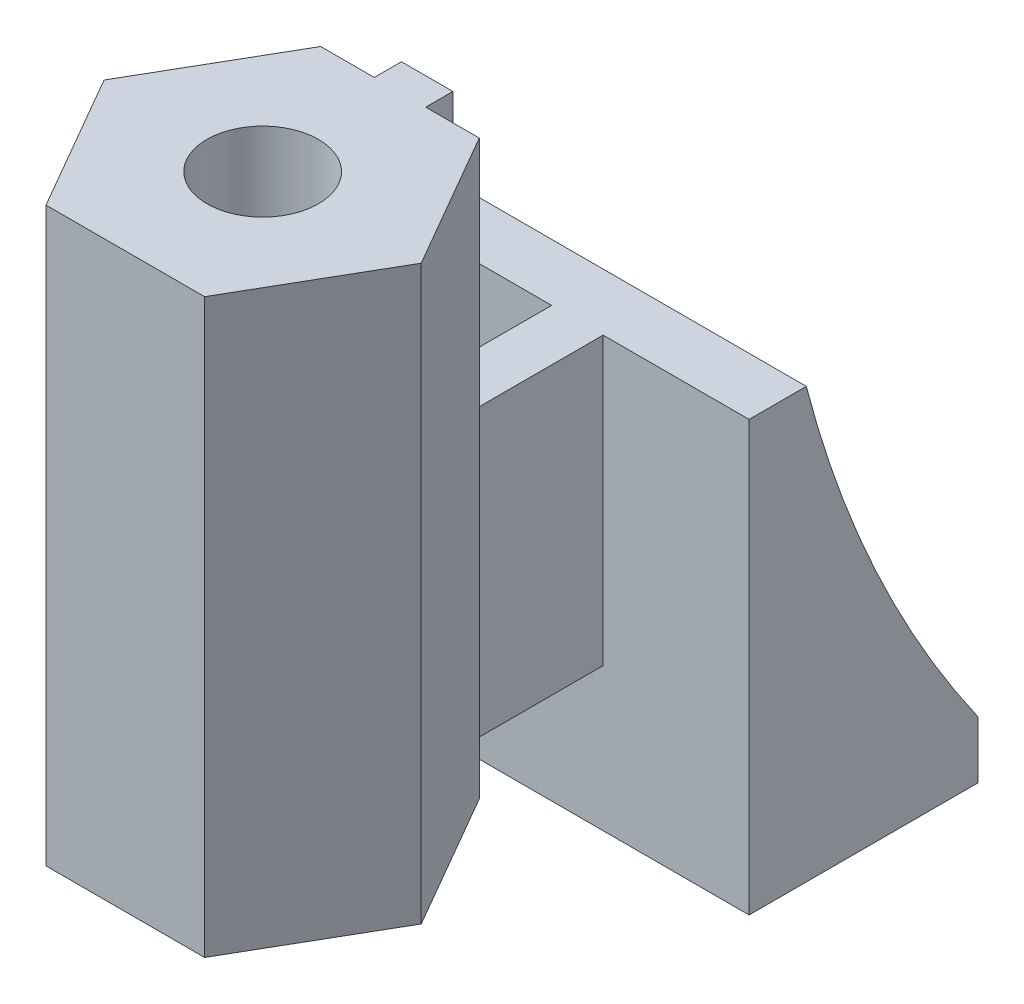
ISO-10303-21;
HEADER;
FILE_DESCRIPTION(('STEP AP214'),'2;1');
FILE_NAME('part.step','',(''),(''),'','','');
FILE_SCHEMA(('AUTOMOTIVE_DESIGN { 1 0 10303 214 1 1 1 1 }'));
ENDSEC;
DATA;
#1=APPLICATION_CONTEXT('core data for automotive mechanical design processes');
#2=APPLICATION_PROTOCOL_DEFINITION('international standard','automotive_design',2000,#1);
#3=PRODUCT_CONTEXT('',#1,'mechanical');
#4=PRODUCT('Part','Part','',(#3));
#5=PRODUCT_RELATED_PRODUCT_CATEGORY('part','',(#4));
#6=PRODUCT_DEFINITION_FORMATION('','',#4);
#7=PRODUCT_DEFINITION_CONTEXT('part definition',#1,'design');
#8=PRODUCT_DEFINITION('design','',#6,#7);
#9=PRODUCT_DEFINITION_SHAPE('','',#8);
#10=(LENGTH_UNIT() NAMED_UNIT(*) SI_UNIT(.MILLI.,.METRE.));
#11=(NAMED_UNIT(*) PLANE_ANGLE_UNIT() SI_UNIT($,.RADIAN.));
#12=(NAMED_UNIT(*) SI_UNIT($,.STERADIAN.) SOLID_ANGLE_UNIT());
#13=UNCERTAINTY_MEASURE_WITH_UNIT(LENGTH_MEASURE(1.E-05),#10,'distance_accuracy_value','');
#14=(GEOMETRIC_REPRESENTATION_CONTEXT(3) GLOBAL_UNCERTAINTY_ASSIGNED_CONTEXT((#13)) GLOBAL_UNIT_ASSIGNED_CONTEXT((#10,
#11,#12)) REPRESENTATION_CONTEXT('',''));
#15=CARTESIAN_POINT('',(0.,0.,0.));
#16=DIRECTION('',(0.,0.,1.));
#17=DIRECTION('',(1.,0.,0.));
#18=AXIS2_PLACEMENT_3D('',#15,#16,#17);
#19=CARTESIAN_POINT('',(-0.9,20.,-4.8));
#20=DIRECTION('',(0.,0.,1.));
#21=DIRECTION('',(1.,0.,0.));
#22=AXIS2_PLACEMENT_3D('',#19,#20,#21);
#23=PLANE('',#22);
#24=DIRECTION('',(-1.,0.,0.));
#25=VECTOR('',#24,1.);
#26=CARTESIAN_POINT('',(-0.9,0.,-4.8));
#27=LINE('',#26,#25);
#28=CARTESIAN_POINT('',(-0.9,0.,-4.8));
#29=VERTEX_POINT('',#28);
#30=CARTESIAN_POINT('',(-2.7712812921102,0.,-4.8));
#31=VERTEX_POINT('',#30);
#32=EDGE_CURVE('E197',#29,#31,#27,.T.);
#33=ORIENTED_EDGE('',*,*,#32,.T.);
#34=DIRECTION('',(0.,-1.,0.));
#35=VECTOR('',#34,1.);
#36=CARTESIAN_POINT('',(-2.7712812921102,20.,-4.8));
#37=LINE('',#36,#35);
#38=CARTESIAN_POINT('',(-2.7712812921102,20.,-4.8));
#39=VERTEX_POINT('',#38);
#40=EDGE_CURVE('E41',#39,#31,#37,.T.);
#41=ORIENTED_EDGE('',*,*,#40,.F.);
#42=DIRECTION('',(-1.,0.,0.));
#43=VECTOR('',#42,1.);
#44=CARTESIAN_POINT('',(-0.9,20.,-4.8));
#45=LINE('',#44,#43);
#46=CARTESIAN_POINT('',(-0.9,20.,-4.8));
#47=VERTEX_POINT('',#46);
#48=EDGE_CURVE('E198',#47,#39,#45,.T.);
#49=ORIENTED_EDGE('',*,*,#48,.F.);
#50=DIRECTION('',(0.,-1.,0.));
#51=VECTOR('',#50,1.);
#52=CARTESIAN_POINT('',(-0.9,20.,-4.8));
#53=LINE('',#52,#51);
#54=EDGE_CURVE('E220',#47,#29,#53,.T.);
#55=ORIENTED_EDGE('',*,*,#54,.T.);
#56=EDGE_LOOP('',(#33,#41,#49,#55));
#57=FACE_BOUND('',#56,.T.);
#58=ADVANCED_FACE('F38',(#57),#23,.F.);
#59=CARTESIAN_POINT('',(-2.7712812921102,20.,-4.8));
#60=DIRECTION('',(0.866025403784439,0.,0.5));
#61=DIRECTION('',(0.5,0.,-0.866025403784439));
#62=AXIS2_PLACEMENT_3D('',#59,#60,#61);
#63=PLANE('',#62);
#64=DIRECTION('',(-0.5,0.,0.866025403784439));
#65=VECTOR('',#64,1.);
#66=CARTESIAN_POINT('',(-2.7712812921102,0.,-4.8));
#67=LINE('',#66,#65);
#68=CARTESIAN_POINT('',(-5.54256258422041,0.,0.));
#69=VERTEX_POINT('',#68);
#70=EDGE_CURVE('E223',#31,#69,#67,.T.);
#71=ORIENTED_EDGE('',*,*,#70,.T.);
#72=DIRECTION('',(0.,-1.,0.));
#73=VECTOR('',#72,1.);
#74=CARTESIAN_POINT('',(-5.54256258422041,20.,0.));
#75=LINE('',#74,#73);
#76=CARTESIAN_POINT('',(-5.54256258422041,20.,0.));
#77=VERTEX_POINT('',#76);
#78=EDGE_CURVE('E261',#77,#69,#75,.T.);
#79=ORIENTED_EDGE('',*,*,#78,.F.);
#80=DIRECTION('',(-0.5,0.,0.866025403784439));
#81=VECTOR('',#80,1.);
#82=CARTESIAN_POINT('',(-2.7712812921102,20.,-4.8));
#83=LINE('',#82,#81);
#84=EDGE_CURVE('E201',#39,#77,#83,.T.);
#85=ORIENTED_EDGE('',*,*,#84,.F.);
#86=ORIENTED_EDGE('',*,*,#40,.T.);
#87=EDGE_LOOP('',(#71,#79,#85,#86));
#88=FACE_BOUND('',#87,.T.);
#89=ADVANCED_FACE('F270',(#88),#63,.F.);
#90=CARTESIAN_POINT('',(-5.54256258422041,20.,0.));
#91=DIRECTION('',(0.866025403784439,0.,-0.5));
#92=DIRECTION('',(-0.5,0.,-0.866025403784439));
#93=AXIS2_PLACEMENT_3D('',#90,#91,#92);
#94=PLANE('',#93);
#95=DIRECTION('',(0.5,0.,0.866025403784438));
#96=VECTOR('',#95,1.);
#97=CARTESIAN_POINT('',(-5.54256258422041,0.,0.));
#98=LINE('',#97,#96);
#99=CARTESIAN_POINT('',(-2.7712812921102,0.,4.8));
#100=VERTEX_POINT('',#99);
#101=EDGE_CURVE('E225',#69,#100,#98,.T.);
#102=ORIENTED_EDGE('',*,*,#101,.T.);
#103=DIRECTION('',(0.,-1.,0.));
#104=VECTOR('',#103,1.);
#105=CARTESIAN_POINT('',(-2.7712812921102,20.,4.8));
#106=LINE('',#105,#104);
#107=CARTESIAN_POINT('',(-2.7712812921102,20.,4.8));
#108=VERTEX_POINT('',#107);
#109=EDGE_CURVE('E259',#108,#100,#106,.T.);
#110=ORIENTED_EDGE('',*,*,#109,.F.);
#111=DIRECTION('',(0.5,0.,0.866025403784438));
#112=VECTOR('',#111,1.);
#113=CARTESIAN_POINT('',(-5.54256258422041,20.,0.));
#114=LINE('',#113,#112);
#115=EDGE_CURVE('E204',#77,#108,#114,.T.);
#116=ORIENTED_EDGE('',*,*,#115,.F.);
#117=ORIENTED_EDGE('',*,*,#78,.T.);
#118=EDGE_LOOP('',(#102,#110,#116,#117));
#119=FACE_BOUND('',#118,.T.);
#120=ADVANCED_FACE('F281',(#119),#94,.F.);
#121=CARTESIAN_POINT('',(-2.7712812921102,20.,4.8));
#122=DIRECTION('',(0.,0.,-1.));
#123=DIRECTION('',(-1.,0.,0.));
#124=AXIS2_PLACEMENT_3D('',#121,#122,#123);
#125=PLANE('',#124);
#126=DIRECTION('',(1.,0.,0.));
#127=VECTOR('',#126,1.);
#128=CARTESIAN_POINT('',(-2.7712812921102,0.,4.8));
#129=LINE('',#128,#127);
#130=CARTESIAN_POINT('',(2.77128129211021,0.,4.8));
#131=VERTEX_POINT('',#130);
#132=EDGE_CURVE('E227',#100,#131,#129,.T.);
#133=ORIENTED_EDGE('',*,*,#132,.T.);
#134=DIRECTION('',(0.,-1.,0.));
#135=VECTOR('',#134,1.);
#136=CARTESIAN_POINT('',(2.77128129211021,20.,4.8));
#137=LINE('',#136,#135);
#138=CARTESIAN_POINT('',(2.77128129211021,20.,4.8));
#139=VERTEX_POINT('',#138);
#140=EDGE_CURVE('E256',#139,#131,#137,.T.);
#141=ORIENTED_EDGE('',*,*,#140,.F.);
#142=DIRECTION('',(1.,0.,0.));
#143=VECTOR('',#142,1.);
#144=CARTESIAN_POINT('',(-2.7712812921102,20.,4.8));
#145=LINE('',#144,#143);
#146=EDGE_CURVE('E206',#108,#139,#145,.T.);
#147=ORIENTED_EDGE('',*,*,#146,.F.);
#148=ORIENTED_EDGE('',*,*,#109,.T.);
#149=EDGE_LOOP('',(#133,#141,#147,#148));
#150=FACE_BOUND('',#149,.T.);
#151=ADVANCED_FACE('F284',(#150),#125,.F.);
#152=CARTESIAN_POINT('',(2.77128129211021,20.,4.8));
#153=DIRECTION('',(-0.866025403784439,0.,-0.5));
#154=DIRECTION('',(-0.5,0.,0.866025403784439));
#155=AXIS2_PLACEMENT_3D('',#152,#153,#154);
#156=PLANE('',#155);
#157=DIRECTION('',(0.5,0.,-0.866025403784439));
#158=VECTOR('',#157,1.);
#159=CARTESIAN_POINT('',(2.77128129211021,0.,4.8));
#160=LINE('',#159,#158);
#161=CARTESIAN_POINT('',(5.54256258422041,0.,0.));
#162=VERTEX_POINT('',#161);
#163=EDGE_CURVE('E229',#131,#162,#160,.T.);
#164=ORIENTED_EDGE('',*,*,#163,.T.);
#165=DIRECTION('',(0.,-1.,0.));
#166=VECTOR('',#165,1.);
#167=CARTESIAN_POINT('',(5.54256258422041,20.,0.));
#168=LINE('',#167,#166);
#169=CARTESIAN_POINT('',(5.54256258422041,20.,0.));
#170=VERTEX_POINT('',#169);
#171=EDGE_CURVE('E253',#170,#162,#168,.T.);
#172=ORIENTED_EDGE('',*,*,#171,.F.);
#173=DIRECTION('',(0.5,0.,-0.866025403784439));
#174=VECTOR('',#173,1.);
#175=CARTESIAN_POINT('',(2.77128129211021,20.,4.8));
#176=LINE('',#175,#174);
#177=EDGE_CURVE('E208',#139,#170,#176,.T.);
#178=ORIENTED_EDGE('',*,*,#177,.F.);
#179=ORIENTED_EDGE('',*,*,#140,.T.);
#180=EDGE_LOOP('',(#164,#172,#178,#179));
#181=FACE_BOUND('',#180,.T.);
#182=ADVANCED_FACE('F317',(#181),#156,.F.);
#183=CARTESIAN_POINT('',(5.54256258422041,20.,0.));
#184=DIRECTION('',(-0.866025403784438,0.,0.5));
#185=DIRECTION('',(0.5,0.,0.866025403784438));
#186=AXIS2_PLACEMENT_3D('',#183,#184,#185);
#187=PLANE('',#186);
#188=DIRECTION('',(-0.5,0.,-0.866025403784439));
#189=VECTOR('',#188,1.);
#190=CARTESIAN_POINT('',(5.54256258422041,0.,0.));
#191=LINE('',#190,#189);
#192=CARTESIAN_POINT('',(2.7712812921102,0.,-4.8));
#193=VERTEX_POINT('',#192);
#194=EDGE_CURVE('E231',#162,#193,#191,.T.);
#195=ORIENTED_EDGE('',*,*,#194,.T.);
#196=DIRECTION('',(0.,-1.,0.));
#197=VECTOR('',#196,1.);
#198=CARTESIAN_POINT('',(2.7712812921102,20.,-4.8));
#199=LINE('',#198,#197);
#200=CARTESIAN_POINT('',(2.7712812921102,20.,-4.8));
#201=VERTEX_POINT('',#200);
#202=EDGE_CURVE('E250',#201,#193,#199,.T.);
#203=ORIENTED_EDGE('',*,*,#202,.F.);
#204=DIRECTION('',(-0.5,0.,-0.866025403784439));
#205=VECTOR('',#204,1.);
#206=CARTESIAN_POINT('',(5.54256258422041,20.,0.));
#207=LINE('',#206,#205);
#208=EDGE_CURVE('E210',#170,#201,#207,.T.);
#209=ORIENTED_EDGE('',*,*,#208,.F.);
#210=ORIENTED_EDGE('',*,*,#171,.T.);
#211=EDGE_LOOP('',(#195,#203,#209,#210));
#212=FACE_BOUND('',#211,.T.);
#213=ADVANCED_FACE('F314',(#212),#187,.F.);
#214=CARTESIAN_POINT('',(2.7712812921102,20.,-4.8));
#215=DIRECTION('',(0.,0.,1.));
#216=DIRECTION('',(1.,0.,0.));
#217=AXIS2_PLACEMENT_3D('',#214,#215,#216);
#218=PLANE('',#217);
#219=DIRECTION('',(-1.,0.,0.));
#220=VECTOR('',#219,1.);
#221=CARTESIAN_POINT('',(2.7712812921102,0.,-4.8));
#222=LINE('',#221,#220);
#223=CARTESIAN_POINT('',(0.9,0.,-4.8));
#224=VERTEX_POINT('',#223);
#225=EDGE_CURVE('E233',#193,#224,#222,.T.);
#226=ORIENTED_EDGE('',*,*,#225,.T.);
#227=DIRECTION('',(0.,-1.,0.));
#228=VECTOR('',#227,1.);
#229=CARTESIAN_POINT('',(0.9,20.,-4.8));
#230=LINE('',#229,#228);
#231=CARTESIAN_POINT('',(0.9,20.,-4.8));
#232=VERTEX_POINT('',#231);
#233=EDGE_CURVE('E247',#232,#224,#230,.T.);
#234=ORIENTED_EDGE('',*,*,#233,.F.);
#235=DIRECTION('',(-1.,0.,0.));
#236=VECTOR('',#235,1.);
#237=CARTESIAN_POINT('',(2.7712812921102,20.,-4.8));
#238=LINE('',#237,#236);
#239=EDGE_CURVE('E212',#201,#232,#238,.T.);
#240=ORIENTED_EDGE('',*,*,#239,.F.);
#241=ORIENTED_EDGE('',*,*,#202,.T.);
#242=EDGE_LOOP('',(#226,#234,#240,#241));
#243=FACE_BOUND('',#242,.T.);
#244=ADVANCED_FACE('F310',(#243),#218,.F.);
#245=CARTESIAN_POINT('',(0.9,20.,-4.8));
#246=DIRECTION('',(-1.,0.,0.));
#247=DIRECTION('',(0.,0.,1.));
#248=AXIS2_PLACEMENT_3D('',#245,#246,#247);
#249=PLANE('',#248);
#250=DIRECTION('',(0.,0.,-1.));
#251=VECTOR('',#250,1.);
#252=CARTESIAN_POINT('',(0.9,0.,-4.8));
#253=LINE('',#252,#251);
#254=CARTESIAN_POINT('',(0.899999999999999,0.,-11.));
#255=VERTEX_POINT('',#254);
#256=EDGE_CURVE('E235',#224,#255,#253,.T.);
#257=ORIENTED_EDGE('',*,*,#256,.T.);
#258=DIRECTION('',(0.,-1.,0.));
#259=VECTOR('',#258,1.);
#260=CARTESIAN_POINT('',(0.899999999999999,10.,-11.));
#261=LINE('',#260,#259);
#262=CARTESIAN_POINT('',(0.899999999999999,10.,-11.));
#263=VERTEX_POINT('',#262);
#264=EDGE_CURVE('E194',#263,#255,#261,.T.);
#265=ORIENTED_EDGE('',*,*,#264,.F.);
#266=DIRECTION('',(0.,0.,1.));
#267=VECTOR('',#266,1.);
#268=CARTESIAN_POINT('',(0.9,10.,-5.75));
#269=LINE('',#268,#267);
#270=CARTESIAN_POINT('',(0.9,10.,-5.75));
#271=VERTEX_POINT('',#270);
#272=EDGE_CURVE('E189',#263,#271,#269,.T.);
#273=ORIENTED_EDGE('',*,*,#272,.T.);
#274=DIRECTION('',(0.,-1.,0.));
#275=VECTOR('',#274,1.);
#276=CARTESIAN_POINT('',(0.9,20.,-5.75));
#277=LINE('',#276,#275);
#278=CARTESIAN_POINT('',(0.9,20.,-5.75));
#279=VERTEX_POINT('',#278);
#280=EDGE_CURVE('E244',#279,#271,#277,.T.);
#281=ORIENTED_EDGE('',*,*,#280,.F.);
#282=DIRECTION('',(0.,0.,-1.));
#283=VECTOR('',#282,1.);
#284=CARTESIAN_POINT('',(0.9,20.,-4.8));
#285=LINE('',#284,#283);
#286=EDGE_CURVE('E214',#232,#279,#285,.T.);
#287=ORIENTED_EDGE('',*,*,#286,.F.);
#288=ORIENTED_EDGE('',*,*,#233,.T.);
#289=EDGE_LOOP('',(#257,#265,#273,#281,#287,#288));
#290=FACE_BOUND('',#289,.T.);
#291=ADVANCED_FACE('F303',(#290),#249,.F.);
#292=CARTESIAN_POINT('',(-0.9,20.,-5.75));
#293=DIRECTION('',(0.,0.,1.));
#294=DIRECTION('',(1.,0.,0.));
#295=AXIS2_PLACEMENT_3D('',#292,#293,#294);
#296=PLANE('',#295);
#297=ORIENTED_EDGE('',*,*,#280,.T.);
#298=DIRECTION('',(-1.,0.,0.));
#299=VECTOR('',#298,1.);
#300=CARTESIAN_POINT('',(0.9,10.,-5.75));
#301=LINE('',#300,#299);
#302=CARTESIAN_POINT('',(-0.9,10.,-5.75));
#303=VERTEX_POINT('',#302);
#304=EDGE_CURVE('E519',#271,#303,#301,.T.);
#305=ORIENTED_EDGE('',*,*,#304,.T.);
#306=DIRECTION('',(0.,-1.,0.));
#307=VECTOR('',#306,1.);
#308=CARTESIAN_POINT('',(-0.9,20.,-5.75));
#309=LINE('',#308,#307);
#310=CARTESIAN_POINT('',(-0.9,20.,-5.75));
#311=VERTEX_POINT('',#310);
#312=EDGE_CURVE('E241',#311,#303,#309,.T.);
#313=ORIENTED_EDGE('',*,*,#312,.F.);
#314=DIRECTION('',(-1.,0.,0.));
#315=VECTOR('',#314,1.);
#316=CARTESIAN_POINT('',(-0.9,20.,-5.75));
#317=LINE('',#316,#315);
#318=EDGE_CURVE('E216',#279,#311,#317,.T.);
#319=ORIENTED_EDGE('',*,*,#318,.F.);
#320=EDGE_LOOP('',(#297,#305,#313,#319));
#321=FACE_BOUND('',#320,.T.);
#322=ADVANCED_FACE('F390',(#321),#296,.F.);
#323=CARTESIAN_POINT('',(-0.9,20.,-4.8));
#324=DIRECTION('',(1.,0.,0.));
#325=DIRECTION('',(0.,0.,-1.));
#326=AXIS2_PLACEMENT_3D('',#323,#324,#325);
#327=PLANE('',#326);
#328=DIRECTION('',(0.,0.,1.));
#329=VECTOR('',#328,1.);
#330=CARTESIAN_POINT('',(-0.9,0.,-4.8));
#331=LINE('',#330,#329);
#332=CARTESIAN_POINT('',(-0.899999999999999,0.,-11.));
#333=VERTEX_POINT('',#332);
#334=EDGE_CURVE('E202',#333,#29,#331,.T.);
#335=ORIENTED_EDGE('',*,*,#334,.T.);
#336=ORIENTED_EDGE('',*,*,#54,.F.);
#337=DIRECTION('',(0.,0.,1.));
#338=VECTOR('',#337,1.);
#339=CARTESIAN_POINT('',(-0.9,20.,-4.8));
#340=LINE('',#339,#338);
#341=EDGE_CURVE('E218',#311,#47,#340,.T.);
#342=ORIENTED_EDGE('',*,*,#341,.F.);
#343=ORIENTED_EDGE('',*,*,#312,.T.);
#344=DIRECTION('',(0.,0.,-1.));
#345=VECTOR('',#344,1.);
#346=CARTESIAN_POINT('',(-0.9,10.,-5.75));
#347=LINE('',#346,#345);
#348=CARTESIAN_POINT('',(-0.899999999999999,10.,-11.));
#349=VERTEX_POINT('',#348);
#350=EDGE_CURVE('E61',#303,#349,#347,.T.);
#351=ORIENTED_EDGE('',*,*,#350,.T.);
#352=DIRECTION('',(0.,-1.,0.));
#353=VECTOR('',#352,1.);
#354=CARTESIAN_POINT('',(-0.899999999999999,10.,-11.));
#355=LINE('',#354,#353);
#356=EDGE_CURVE('E183',#349,#333,#355,.T.);
#357=ORIENTED_EDGE('',*,*,#356,.T.);
#358=EDGE_LOOP('',(#335,#336,#342,#343,#351,#357));
#359=FACE_BOUND('',#358,.T.);
#360=ADVANCED_FACE('F294',(#359),#327,.F.);
#361=CARTESIAN_POINT('',(0.,20.,0.));
#362=DIRECTION('',(0.,-1.,0.));
#363=DIRECTION('',(0.,0.,-1.));
#364=AXIS2_PLACEMENT_3D('',#361,#362,#363);
#365=PLANE('',#364);
#366=CARTESIAN_POINT('',(0.,20.,0.));
#367=DIRECTION('',(0.,-1.,0.));
#368=DIRECTION('',(0.,0.,-1.));
#369=AXIS2_PLACEMENT_3D('',#366,#367,#368);
#370=CIRCLE('',#369,1.95);
#371=CARTESIAN_POINT('',(0.,20.,-1.95));
#372=VERTEX_POINT('',#371);
#373=EDGE_CURVE('E193',#372,#372,#370,.F.);
#374=ORIENTED_EDGE('',*,*,#373,.F.);
#375=EDGE_LOOP('',(#374));
#376=FACE_BOUND('',#375,.T.);
#377=ORIENTED_EDGE('',*,*,#48,.T.);
#378=ORIENTED_EDGE('',*,*,#84,.T.);
#379=ORIENTED_EDGE('',*,*,#115,.T.);
#380=ORIENTED_EDGE('',*,*,#146,.T.);
#381=ORIENTED_EDGE('',*,*,#177,.T.);
#382=ORIENTED_EDGE('',*,*,#208,.T.);
#383=ORIENTED_EDGE('',*,*,#239,.T.);
#384=ORIENTED_EDGE('',*,*,#286,.T.);
#385=ORIENTED_EDGE('',*,*,#318,.T.);
#386=ORIENTED_EDGE('',*,*,#341,.T.);
#387=EDGE_LOOP('',(#377,#378,#379,#380,#381,#382,#383,#384,#385,#386));
#388=FACE_BOUND('',#387,.T.);
#389=ADVANCED_FACE('F288',(#376,#388),#365,.F.);
#390=CARTESIAN_POINT('',(0.,0.,0.));
#391=DIRECTION('',(0.,-1.,0.));
#392=DIRECTION('',(0.,0.,-1.));
#393=AXIS2_PLACEMENT_3D('',#390,#391,#392);
#394=PLANE('',#393);
#395=DIRECTION('',(-1.,0.,0.));
#396=VECTOR('',#395,1.);
#397=CARTESIAN_POINT('',(6.,0.,-11.));
#398=LINE('',#397,#396);
#399=EDGE_CURVE('E11',#255,#333,#398,.T.);
#400=ORIENTED_EDGE('',*,*,#399,.F.);
#401=ORIENTED_EDGE('',*,*,#256,.F.);
#402=ORIENTED_EDGE('',*,*,#225,.F.);
#403=ORIENTED_EDGE('',*,*,#194,.F.);
#404=ORIENTED_EDGE('',*,*,#163,.F.);
#405=ORIENTED_EDGE('',*,*,#132,.F.);
#406=ORIENTED_EDGE('',*,*,#101,.F.);
#407=ORIENTED_EDGE('',*,*,#70,.F.);
#408=ORIENTED_EDGE('',*,*,#32,.F.);
#409=ORIENTED_EDGE('',*,*,#334,.F.);
#410=EDGE_LOOP('',(#400,#401,#402,#403,#404,#405,#406,#407,#408,#409));
#411=FACE_BOUND('',#410,.T.);
#412=CARTESIAN_POINT('',(0.,0.,0.));
#413=DIRECTION('',(0.,-1.,0.));
#414=DIRECTION('',(0.,0.,-1.));
#415=AXIS2_PLACEMENT_3D('',#412,#413,#414);
#416=CIRCLE('',#415,1.95);
#417=CARTESIAN_POINT('',(0.,0.,-1.95));
#418=VERTEX_POINT('',#417);
#419=EDGE_CURVE('E190',#418,#418,#416,.T.);
#420=ORIENTED_EDGE('',*,*,#419,.F.);
#421=EDGE_LOOP('',(#420));
#422=FACE_BOUND('',#421,.T.);
#423=ADVANCED_FACE('F276',(#411,#422),#394,.T.);
#424=CARTESIAN_POINT('',(0.,25.5154328932551,0.));
#425=DIRECTION('',(0.,-1.,0.));
#426=DIRECTION('',(0.,0.,-1.));
#427=AXIS2_PLACEMENT_3D('',#424,#425,#426);
#428=CYLINDRICAL_SURFACE('',#427,1.95);
#429=ORIENTED_EDGE('',*,*,#373,.T.);
#430=EDGE_LOOP('',(#429));
#431=FACE_BOUND('',#430,.T.);
#432=ORIENTED_EDGE('',*,*,#419,.T.);
#433=EDGE_LOOP('',(#432));
#434=FACE_BOUND('',#433,.T.);
#435=ADVANCED_FACE('F378',(#431,#434),#428,.F.);
#436=CARTESIAN_POINT('',(0.899999999999999,10.,-11.));
#437=DIRECTION('',(0.,0.,1.));
#438=DIRECTION('',(1.,0.,0.));
#439=AXIS2_PLACEMENT_3D('',#436,#437,#438);
#440=PLANE('',#439);
#441=ORIENTED_EDGE('',*,*,#264,.T.);
#442=ORIENTED_EDGE('',*,*,#399,.T.);
#443=ORIENTED_EDGE('',*,*,#356,.F.);
#444=DIRECTION('',(-1.,0.,0.));
#445=VECTOR('',#444,1.);
#446=CARTESIAN_POINT('',(-0.899999999999999,10.,-11.));
#447=LINE('',#446,#445);
#448=CARTESIAN_POINT('',(-6.,10.,-11.));
#449=VERTEX_POINT('',#448);
#450=EDGE_CURVE('E502',#349,#449,#447,.T.);
#451=ORIENTED_EDGE('',*,*,#450,.T.);
#452=DIRECTION('',(0.,-1.,0.));
#453=VECTOR('',#452,1.);
#454=CARTESIAN_POINT('',(-6.,10.,-11.));
#455=LINE('',#454,#453);
#456=CARTESIAN_POINT('',(-6.,-5.,-11.));
#457=VERTEX_POINT('',#456);
#458=EDGE_CURVE('E179',#449,#457,#455,.T.);
#459=ORIENTED_EDGE('',*,*,#458,.T.);
#460=DIRECTION('',(-1.,0.,0.));
#461=VECTOR('',#460,1.);
#462=CARTESIAN_POINT('',(6.,-5.,-11.));
#463=LINE('',#462,#461);
#464=CARTESIAN_POINT('',(6.,-5.,-11.));
#465=VERTEX_POINT('',#464);
#466=EDGE_CURVE('E512',#465,#457,#463,.T.);
#467=ORIENTED_EDGE('',*,*,#466,.F.);
#468=DIRECTION('',(0.,-1.,0.));
#469=VECTOR('',#468,1.);
#470=CARTESIAN_POINT('',(6.,10.,-11.));
#471=LINE('',#470,#469);
#472=CARTESIAN_POINT('',(6.,10.,-11.));
#473=VERTEX_POINT('',#472);
#474=EDGE_CURVE('E181',#473,#465,#471,.T.);
#475=ORIENTED_EDGE('',*,*,#474,.F.);
#476=DIRECTION('',(-1.,0.,0.));
#477=VECTOR('',#476,1.);
#478=CARTESIAN_POINT('',(0.899999999999999,10.,-11.));
#479=LINE('',#478,#477);
#480=EDGE_CURVE('E498',#473,#263,#479,.T.);
#481=ORIENTED_EDGE('',*,*,#480,.T.);
#482=EDGE_LOOP('',(#441,#442,#443,#451,#459,#467,#475,#481));
#483=FACE_BOUND('',#482,.T.);
#484=ADVANCED_FACE('F298',(#483),#440,.T.);
#485=CARTESIAN_POINT('',(6.,10.,-11.));
#486=DIRECTION('',(1.,0.,0.));
#487=DIRECTION('',(0.,0.,-1.));
#488=AXIS2_PLACEMENT_3D('',#485,#486,#487);
#489=PLANE('',#488);
#490=CARTESIAN_POINT('',(6.,19.9916830480123,-51.7319799373601));
#491=DIRECTION('',(1.,0.,0.));
#492=DIRECTION('',(0.,0.,-1.));
#493=AXIS2_PLACEMENT_3D('',#490,#491,#492);
#494=CIRCLE('',#493,40.);
#495=CARTESIAN_POINT('',(6.,10.,-13.));
#496=VERTEX_POINT('',#495);
#497=CARTESIAN_POINT('',(6.,-3.,-19.));
#498=VERTEX_POINT('',#497);
#499=EDGE_CURVE('E159',#496,#498,#494,.T.);
#500=ORIENTED_EDGE('',*,*,#499,.F.);
#501=DIRECTION('',(0.,0.,1.));
#502=VECTOR('',#501,1.);
#503=CARTESIAN_POINT('',(6.,10.,-11.));
#504=LINE('',#503,#502);
#505=EDGE_CURVE('E496',#496,#473,#504,.T.);
#506=ORIENTED_EDGE('',*,*,#505,.T.);
#507=ORIENTED_EDGE('',*,*,#474,.T.);
#508=DIRECTION('',(0.,0.,1.));
#509=VECTOR('',#508,1.);
#510=CARTESIAN_POINT('',(6.,-5.,-19.));
#511=LINE('',#510,#509);
#512=CARTESIAN_POINT('',(6.,-5.,-19.));
#513=VERTEX_POINT('',#512);
#514=EDGE_CURVE('E510',#513,#465,#511,.T.);
#515=ORIENTED_EDGE('',*,*,#514,.F.);
#516=DIRECTION('',(0.,-1.,0.));
#517=VECTOR('',#516,1.);
#518=CARTESIAN_POINT('',(6.,10.,-19.));
#519=LINE('',#518,#517);
#520=EDGE_CURVE('E178',#498,#513,#519,.T.);
#521=ORIENTED_EDGE('',*,*,#520,.F.);
#522=EDGE_LOOP('',(#500,#506,#507,#515,#521));
#523=FACE_BOUND('',#522,.T.);
#524=ADVANCED_FACE('F424',(#523),#489,.T.);
#525=CARTESIAN_POINT('',(6.,10.,-19.));
#526=DIRECTION('',(0.,0.,-1.));
#527=DIRECTION('',(-1.,0.,0.));
#528=AXIS2_PLACEMENT_3D('',#525,#526,#527);
#529=PLANE('',#528);
#530=DIRECTION('',(1.,0.,0.));
#531=VECTOR('',#530,1.);
#532=CARTESIAN_POINT('',(-6.001,-3.,-19.));
#533=LINE('',#532,#531);
#534=CARTESIAN_POINT('',(-6.,-3.,-19.));
#535=VERTEX_POINT('',#534);
#536=EDGE_CURVE('E156',#535,#498,#533,.T.);
#537=ORIENTED_EDGE('',*,*,#536,.T.);
#538=ORIENTED_EDGE('',*,*,#520,.T.);
#539=DIRECTION('',(1.,0.,0.));
#540=VECTOR('',#539,1.);
#541=CARTESIAN_POINT('',(6.,-5.,-19.));
#542=LINE('',#541,#540);
#543=CARTESIAN_POINT('',(-6.,-5.,-19.));
#544=VERTEX_POINT('',#543);
#545=EDGE_CURVE('E177',#544,#513,#542,.T.);
#546=ORIENTED_EDGE('',*,*,#545,.F.);
#547=DIRECTION('',(0.,-1.,0.));
#548=VECTOR('',#547,1.);
#549=CARTESIAN_POINT('',(-6.,10.,-19.));
#550=LINE('',#549,#548);
#551=EDGE_CURVE('E169',#535,#544,#550,.T.);
#552=ORIENTED_EDGE('',*,*,#551,.F.);
#553=EDGE_LOOP('',(#537,#538,#546,#552));
#554=FACE_BOUND('',#553,.T.);
#555=ADVANCED_FACE('F175',(#554),#529,.T.);
#556=CARTESIAN_POINT('',(-6.,10.,-11.));
#557=DIRECTION('',(-1.,0.,0.));
#558=DIRECTION('',(0.,0.,1.));
#559=AXIS2_PLACEMENT_3D('',#556,#557,#558);
#560=PLANE('',#559);
#561=CARTESIAN_POINT('',(-6.,19.9916830480123,-51.7319799373601));
#562=DIRECTION('',(-1.,0.,0.));
#563=DIRECTION('',(0.,0.,1.));
#564=AXIS2_PLACEMENT_3D('',#561,#562,#563);
#565=CIRCLE('',#564,40.);
#566=CARTESIAN_POINT('',(-6.,10.,-13.));
#567=VERTEX_POINT('',#566);
#568=EDGE_CURVE('E53',#567,#535,#565,.F.);
#569=ORIENTED_EDGE('',*,*,#568,.T.);
#570=ORIENTED_EDGE('',*,*,#551,.T.);
#571=DIRECTION('',(0.,0.,-1.));
#572=VECTOR('',#571,1.);
#573=CARTESIAN_POINT('',(-6.,-5.,-19.));
#574=LINE('',#573,#572);
#575=EDGE_CURVE('E513',#457,#544,#574,.T.);
#576=ORIENTED_EDGE('',*,*,#575,.F.);
#577=ORIENTED_EDGE('',*,*,#458,.F.);
#578=DIRECTION('',(0.,0.,-1.));
#579=VECTOR('',#578,1.);
#580=CARTESIAN_POINT('',(-6.,10.,-11.));
#581=LINE('',#580,#579);
#582=EDGE_CURVE('E172',#449,#567,#581,.T.);
#583=ORIENTED_EDGE('',*,*,#582,.T.);
#584=EDGE_LOOP('',(#569,#570,#576,#577,#583));
#585=FACE_BOUND('',#584,.T.);
#586=ADVANCED_FACE('F167',(#585),#560,.T.);
#587=CARTESIAN_POINT('',(0.,10.,0.));
#588=DIRECTION('',(0.,-1.,0.));
#589=DIRECTION('',(0.,0.,-1.));
#590=AXIS2_PLACEMENT_3D('',#587,#588,#589);
#591=PLANE('',#590);
#592=ORIENTED_EDGE('',*,*,#505,.F.);
#593=DIRECTION('',(1.,0.,0.));
#594=VECTOR('',#593,1.);
#595=CARTESIAN_POINT('',(-6.001,10.,-13.));
#596=LINE('',#595,#594);
#597=EDGE_CURVE('E163',#567,#496,#596,.T.);
#598=ORIENTED_EDGE('',*,*,#597,.F.);
#599=ORIENTED_EDGE('',*,*,#582,.F.);
#600=ORIENTED_EDGE('',*,*,#450,.F.);
#601=ORIENTED_EDGE('',*,*,#350,.F.);
#602=ORIENTED_EDGE('',*,*,#304,.F.);
#603=ORIENTED_EDGE('',*,*,#272,.F.);
#604=ORIENTED_EDGE('',*,*,#480,.F.);
#605=EDGE_LOOP('',(#592,#598,#599,#600,#601,#602,#603,#604));
#606=FACE_BOUND('',#605,.T.);
#607=ADVANCED_FACE('F437',(#606),#591,.F.);
#608=CARTESIAN_POINT('',(0.,-5.,0.));
#609=DIRECTION('',(0.,-1.,0.));
#610=DIRECTION('',(0.,0.,-1.));
#611=AXIS2_PLACEMENT_3D('',#608,#609,#610);
#612=PLANE('',#611);
#613=ORIENTED_EDGE('',*,*,#514,.T.);
#614=ORIENTED_EDGE('',*,*,#466,.T.);
#615=ORIENTED_EDGE('',*,*,#575,.T.);
#616=ORIENTED_EDGE('',*,*,#545,.T.);
#617=EDGE_LOOP('',(#613,#614,#615,#616));
#618=FACE_BOUND('',#617,.T.);
#619=ADVANCED_FACE('F432',(#618),#612,.T.);
#620=CARTESIAN_POINT('',(-6.001,19.9916830480123,-51.7319799373601));
#621=DIRECTION('',(1.,0.,0.));
#622=DIRECTION('',(0.,0.,-1.));
#623=AXIS2_PLACEMENT_3D('',#620,#621,#622);
#624=CYLINDRICAL_SURFACE('',#623,40.);
#625=ORIENTED_EDGE('',*,*,#597,.T.);
#626=ORIENTED_EDGE('',*,*,#499,.T.);
#627=ORIENTED_EDGE('',*,*,#536,.F.);
#628=ORIENTED_EDGE('',*,*,#568,.F.);
#629=EDGE_LOOP('',(#625,#626,#627,#628));
#630=FACE_BOUND('',#629,.T.);
#631=ADVANCED_FACE('F157',(#630),#624,.F.);
#632=CLOSED_SHELL('',(#58,#89,#120,#151,#182,#213,#244,#291,#322,#360,#389,#423,#435,#484,#524,
#555,#586,#607,#619,#631));
#633=MANIFOLD_SOLID_BREP('B2',#632);
#634=ADVANCED_BREP_SHAPE_REPRESENTATION('',(#18,#633),#14);
#635=SHAPE_DEFINITION_REPRESENTATION(#9,#634);
ENDSEC;
END-ISO-10303-21;
